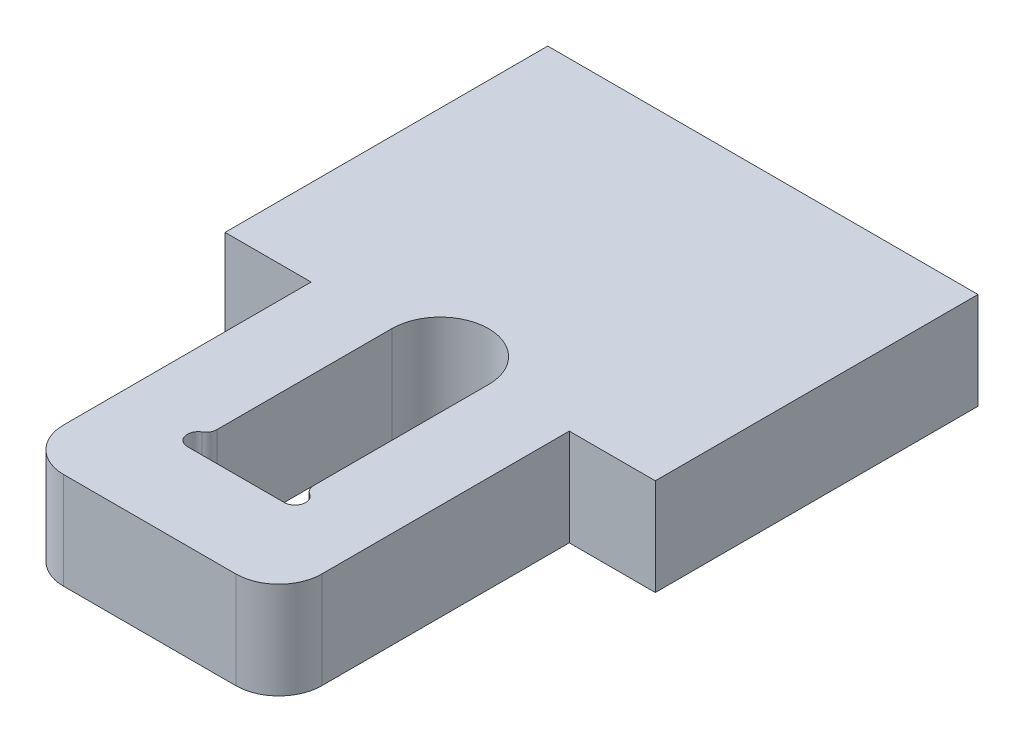
ISO-10303-21;
HEADER;
FILE_DESCRIPTION(('STEP AP214'),'2;1');
FILE_NAME('part.step','',(''),(''),'','','');
FILE_SCHEMA(('AUTOMOTIVE_DESIGN { 1 0 10303 214 1 1 1 1 }'));
ENDSEC;
DATA;
#1=APPLICATION_CONTEXT('core data for automotive mechanical design processes');
#2=APPLICATION_PROTOCOL_DEFINITION('international standard','automotive_design',2000,#1);
#3=PRODUCT_CONTEXT('',#1,'mechanical');
#4=PRODUCT('Part','Part','',(#3));
#5=PRODUCT_RELATED_PRODUCT_CATEGORY('part','',(#4));
#6=PRODUCT_DEFINITION_FORMATION('','',#4);
#7=PRODUCT_DEFINITION_CONTEXT('part definition',#1,'design');
#8=PRODUCT_DEFINITION('design','',#6,#7);
#9=PRODUCT_DEFINITION_SHAPE('','',#8);
#10=(LENGTH_UNIT() NAMED_UNIT(*) SI_UNIT(.MILLI.,.METRE.));
#11=(NAMED_UNIT(*) PLANE_ANGLE_UNIT() SI_UNIT($,.RADIAN.));
#12=(NAMED_UNIT(*) SI_UNIT($,.STERADIAN.) SOLID_ANGLE_UNIT());
#13=UNCERTAINTY_MEASURE_WITH_UNIT(LENGTH_MEASURE(1.E-05),#10,'distance_accuracy_value','');
#14=(GEOMETRIC_REPRESENTATION_CONTEXT(3) GLOBAL_UNCERTAINTY_ASSIGNED_CONTEXT((#13)) GLOBAL_UNIT_ASSIGNED_CONTEXT((#10,
#11,#12)) REPRESENTATION_CONTEXT('',''));
#15=CARTESIAN_POINT('',(0.,0.,0.));
#16=DIRECTION('',(0.,0.,1.));
#17=DIRECTION('',(1.,0.,0.));
#18=AXIS2_PLACEMENT_3D('',#15,#16,#17);
#19=CARTESIAN_POINT('',(4.,4.5,11.5));
#20=DIRECTION('',(0.,1.,0.));
#21=DIRECTION('',(0.,0.,1.));
#22=AXIS2_PLACEMENT_3D('',#19,#20,#21);
#23=PLANE('',#22);
#24=DIRECTION('',(1.,0.,0.));
#25=VECTOR('',#24,1.);
#26=CARTESIAN_POINT('',(-6.,4.5,0.));
#27=LINE('',#26,#25);
#28=CARTESIAN_POINT('',(-10.,4.5,0.));
#29=VERTEX_POINT('',#28);
#30=CARTESIAN_POINT('',(-6.,4.5,0.));
#31=VERTEX_POINT('',#30);
#32=EDGE_CURVE('E223',#29,#31,#27,.T.);
#33=ORIENTED_EDGE('',*,*,#32,.T.);
#34=DIRECTION('',(0.,0.,1.));
#35=VECTOR('',#34,1.);
#36=CARTESIAN_POINT('',(-6.,4.5,0.));
#37=LINE('',#36,#35);
#38=CARTESIAN_POINT('',(-6.,4.5,11.5));
#39=VERTEX_POINT('',#38);
#40=EDGE_CURVE('E226',#31,#39,#37,.T.);
#41=ORIENTED_EDGE('',*,*,#40,.T.);
#42=CARTESIAN_POINT('',(-4.,4.5,11.5));
#43=DIRECTION('',(0.,1.,0.));
#44=DIRECTION('',(0.,0.,-1.));
#45=AXIS2_PLACEMENT_3D('',#42,#43,#44);
#46=CIRCLE('',#45,2.);
#47=CARTESIAN_POINT('',(-4.,4.5,13.5));
#48=VERTEX_POINT('',#47);
#49=EDGE_CURVE('E229',#39,#48,#46,.T.);
#50=ORIENTED_EDGE('',*,*,#49,.T.);
#51=DIRECTION('',(1.,0.,0.));
#52=VECTOR('',#51,1.);
#53=CARTESIAN_POINT('',(-4.,4.5,13.5));
#54=LINE('',#53,#52);
#55=CARTESIAN_POINT('',(4.,4.5,13.5));
#56=VERTEX_POINT('',#55);
#57=EDGE_CURVE('E231',#48,#56,#54,.T.);
#58=ORIENTED_EDGE('',*,*,#57,.T.);
#59=CARTESIAN_POINT('',(4.,4.5,11.5));
#60=DIRECTION('',(0.,1.,0.));
#61=DIRECTION('',(0.,0.,1.));
#62=AXIS2_PLACEMENT_3D('',#59,#60,#61);
#63=CIRCLE('',#62,2.);
#64=CARTESIAN_POINT('',(6.,4.5,11.5));
#65=VERTEX_POINT('',#64);
#66=EDGE_CURVE('E233',#56,#65,#63,.T.);
#67=ORIENTED_EDGE('',*,*,#66,.T.);
#68=DIRECTION('',(0.,0.,-1.));
#69=VECTOR('',#68,1.);
#70=CARTESIAN_POINT('',(6.,4.5,11.5));
#71=LINE('',#70,#69);
#72=CARTESIAN_POINT('',(6.,4.5,0.));
#73=VERTEX_POINT('',#72);
#74=EDGE_CURVE('E235',#65,#73,#71,.T.);
#75=ORIENTED_EDGE('',*,*,#74,.T.);
#76=DIRECTION('',(1.,0.,0.));
#77=VECTOR('',#76,1.);
#78=CARTESIAN_POINT('',(6.,4.5,0.));
#79=LINE('',#78,#77);
#80=CARTESIAN_POINT('',(10.,4.5,0.));
#81=VERTEX_POINT('',#80);
#82=EDGE_CURVE('E237',#73,#81,#79,.T.);
#83=ORIENTED_EDGE('',*,*,#82,.T.);
#84=DIRECTION('',(0.,0.,-1.));
#85=VECTOR('',#84,1.);
#86=CARTESIAN_POINT('',(10.,4.5,0.));
#87=LINE('',#86,#85);
#88=CARTESIAN_POINT('',(10.,4.5,-15.));
#89=VERTEX_POINT('',#88);
#90=EDGE_CURVE('E239',#81,#89,#87,.T.);
#91=ORIENTED_EDGE('',*,*,#90,.T.);
#92=DIRECTION('',(-1.,0.,0.));
#93=VECTOR('',#92,1.);
#94=CARTESIAN_POINT('',(-10.,4.5,-15.));
#95=LINE('',#94,#93);
#96=CARTESIAN_POINT('',(-10.,4.5,-15.));
#97=VERTEX_POINT('',#96);
#98=EDGE_CURVE('E241',#89,#97,#95,.T.);
#99=ORIENTED_EDGE('',*,*,#98,.T.);
#100=DIRECTION('',(0.,0.,1.));
#101=VECTOR('',#100,1.);
#102=CARTESIAN_POINT('',(-10.,4.5,0.));
#103=LINE('',#102,#101);
#104=EDGE_CURVE('E243',#97,#29,#103,.T.);
#105=ORIENTED_EDGE('',*,*,#104,.T.);
#106=EDGE_LOOP('',(#33,#41,#50,#58,#67,#75,#83,#91,#99,#105));
#107=FACE_BOUND('',#106,.T.);
#108=CARTESIAN_POINT('',(2.75,4.5,8.13397459621556));
#109=DIRECTION('',(0.,-1.,0.));
#110=DIRECTION('',(0.,0.,-1.));
#111=AXIS2_PLACEMENT_3D('',#108,#109,#110);
#112=CIRCLE('',#111,0.5);
#113=CARTESIAN_POINT('',(2.5,4.5,8.56698729810778));
#114=VERTEX_POINT('',#113);
#115=CARTESIAN_POINT('',(2.25,4.5,8.13397459621556));
#116=VERTEX_POINT('',#115);
#117=EDGE_CURVE('E166',#114,#116,#112,.T.);
#118=ORIENTED_EDGE('',*,*,#117,.F.);
#119=CARTESIAN_POINT('',(2.25,4.5,9.));
#120=DIRECTION('',(0.,1.,0.));
#121=DIRECTION('',(0.,0.,1.));
#122=AXIS2_PLACEMENT_3D('',#119,#120,#121);
#123=CIRCLE('',#122,0.499999999999999);
#124=CARTESIAN_POINT('',(2.25,4.5,9.5));
#125=VERTEX_POINT('',#124);
#126=EDGE_CURVE('E158',#125,#114,#123,.T.);
#127=ORIENTED_EDGE('',*,*,#126,.F.);
#128=DIRECTION('',(1.,0.,0.));
#129=VECTOR('',#128,1.);
#130=CARTESIAN_POINT('',(-2.25,4.5,9.5));
#131=LINE('',#130,#129);
#132=CARTESIAN_POINT('',(-2.25,4.5,9.5));
#133=VERTEX_POINT('',#132);
#134=EDGE_CURVE('E191',#133,#125,#131,.T.);
#135=ORIENTED_EDGE('',*,*,#134,.F.);
#136=CARTESIAN_POINT('',(-2.25,4.5,9.));
#137=DIRECTION('',(0.,1.,0.));
#138=DIRECTION('',(0.,0.,-1.));
#139=AXIS2_PLACEMENT_3D('',#136,#137,#138);
#140=CIRCLE('',#139,0.499999999999999);
#141=CARTESIAN_POINT('',(-2.5,4.5,8.56698729810778));
#142=VERTEX_POINT('',#141);
#143=EDGE_CURVE('E189',#142,#133,#140,.T.);
#144=ORIENTED_EDGE('',*,*,#143,.F.);
#145=CARTESIAN_POINT('',(-2.75,4.5,8.13397459621556));
#146=DIRECTION('',(0.,-1.,0.));
#147=DIRECTION('',(0.,0.,1.));
#148=AXIS2_PLACEMENT_3D('',#145,#146,#147);
#149=CIRCLE('',#148,0.5);
#150=CARTESIAN_POINT('',(-2.25,4.5,8.13397459621556));
#151=VERTEX_POINT('',#150);
#152=EDGE_CURVE('E187',#151,#142,#149,.T.);
#153=ORIENTED_EDGE('',*,*,#152,.F.);
#154=DIRECTION('',(0.,0.,1.));
#155=VECTOR('',#154,1.);
#156=CARTESIAN_POINT('',(-2.25,4.5,0.));
#157=LINE('',#156,#155);
#158=CARTESIAN_POINT('',(-2.25,4.5,0.));
#159=VERTEX_POINT('',#158);
#160=EDGE_CURVE('E185',#159,#151,#157,.T.);
#161=ORIENTED_EDGE('',*,*,#160,.F.);
#162=CARTESIAN_POINT('',(0.,4.5,0.));
#163=DIRECTION('',(0.,1.,0.));
#164=DIRECTION('',(0.,0.,-1.));
#165=AXIS2_PLACEMENT_3D('',#162,#163,#164);
#166=CIRCLE('',#165,2.25);
#167=CARTESIAN_POINT('',(2.25,4.5,0.));
#168=VERTEX_POINT('',#167);
#169=EDGE_CURVE('E181',#168,#159,#166,.T.);
#170=ORIENTED_EDGE('',*,*,#169,.F.);
#171=DIRECTION('',(0.,0.,-1.));
#172=VECTOR('',#171,1.);
#173=CARTESIAN_POINT('',(2.25,4.5,0.));
#174=LINE('',#173,#172);
#175=EDGE_CURVE('E179',#116,#168,#174,.T.);
#176=ORIENTED_EDGE('',*,*,#175,.F.);
#177=EDGE_LOOP('',(#118,#127,#135,#144,#153,#161,#170,#176));
#178=FACE_BOUND('',#177,.T.);
#179=ADVANCED_FACE('F33',(#107,#178),#23,.T.);
#180=CARTESIAN_POINT('',(4.,0.,11.5));
#181=DIRECTION('',(0.,1.,0.));
#182=DIRECTION('',(0.,0.,1.));
#183=AXIS2_PLACEMENT_3D('',#180,#181,#182);
#184=PLANE('',#183);
#185=DIRECTION('',(1.,0.,0.));
#186=VECTOR('',#185,1.);
#187=CARTESIAN_POINT('',(-6.,0.,0.));
#188=LINE('',#187,#186);
#189=CARTESIAN_POINT('',(-10.,0.,0.));
#190=VERTEX_POINT('',#189);
#191=CARTESIAN_POINT('',(-6.,0.,0.));
#192=VERTEX_POINT('',#191);
#193=EDGE_CURVE('E174',#190,#192,#188,.T.);
#194=ORIENTED_EDGE('',*,*,#193,.F.);
#195=DIRECTION('',(0.,0.,1.));
#196=VECTOR('',#195,1.);
#197=CARTESIAN_POINT('',(-10.,0.,0.));
#198=LINE('',#197,#196);
#199=CARTESIAN_POINT('',(-10.,0.,-15.));
#200=VERTEX_POINT('',#199);
#201=EDGE_CURVE('E227',#200,#190,#198,.T.);
#202=ORIENTED_EDGE('',*,*,#201,.F.);
#203=DIRECTION('',(-1.,0.,0.));
#204=VECTOR('',#203,1.);
#205=CARTESIAN_POINT('',(-10.,0.,-15.));
#206=LINE('',#205,#204);
#207=CARTESIAN_POINT('',(10.,0.,-15.));
#208=VERTEX_POINT('',#207);
#209=EDGE_CURVE('E262',#208,#200,#206,.T.);
#210=ORIENTED_EDGE('',*,*,#209,.F.);
#211=DIRECTION('',(0.,0.,-1.));
#212=VECTOR('',#211,1.);
#213=CARTESIAN_POINT('',(10.,0.,0.));
#214=LINE('',#213,#212);
#215=CARTESIAN_POINT('',(10.,0.,0.));
#216=VERTEX_POINT('',#215);
#217=EDGE_CURVE('E260',#216,#208,#214,.T.);
#218=ORIENTED_EDGE('',*,*,#217,.F.);
#219=DIRECTION('',(1.,0.,0.));
#220=VECTOR('',#219,1.);
#221=CARTESIAN_POINT('',(6.,0.,0.));
#222=LINE('',#221,#220);
#223=CARTESIAN_POINT('',(6.,0.,0.));
#224=VERTEX_POINT('',#223);
#225=EDGE_CURVE('E258',#224,#216,#222,.T.);
#226=ORIENTED_EDGE('',*,*,#225,.F.);
#227=DIRECTION('',(0.,0.,-1.));
#228=VECTOR('',#227,1.);
#229=CARTESIAN_POINT('',(6.,0.,11.5));
#230=LINE('',#229,#228);
#231=CARTESIAN_POINT('',(6.,0.,11.5));
#232=VERTEX_POINT('',#231);
#233=EDGE_CURVE('E256',#232,#224,#230,.T.);
#234=ORIENTED_EDGE('',*,*,#233,.F.);
#235=CARTESIAN_POINT('',(4.,0.,11.5));
#236=DIRECTION('',(0.,1.,0.));
#237=DIRECTION('',(0.,0.,1.));
#238=AXIS2_PLACEMENT_3D('',#235,#236,#237);
#239=CIRCLE('',#238,2.);
#240=CARTESIAN_POINT('',(4.,0.,13.5));
#241=VERTEX_POINT('',#240);
#242=EDGE_CURVE('E254',#241,#232,#239,.T.);
#243=ORIENTED_EDGE('',*,*,#242,.F.);
#244=DIRECTION('',(1.,0.,0.));
#245=VECTOR('',#244,1.);
#246=CARTESIAN_POINT('',(-4.,0.,13.5));
#247=LINE('',#246,#245);
#248=CARTESIAN_POINT('',(-4.,0.,13.5));
#249=VERTEX_POINT('',#248);
#250=EDGE_CURVE('E252',#249,#241,#247,.T.);
#251=ORIENTED_EDGE('',*,*,#250,.F.);
#252=CARTESIAN_POINT('',(-4.,0.,11.5));
#253=DIRECTION('',(0.,1.,0.));
#254=DIRECTION('',(0.,0.,-1.));
#255=AXIS2_PLACEMENT_3D('',#252,#253,#254);
#256=CIRCLE('',#255,2.);
#257=CARTESIAN_POINT('',(-6.,0.,11.5));
#258=VERTEX_POINT('',#257);
#259=EDGE_CURVE('E250',#258,#249,#256,.T.);
#260=ORIENTED_EDGE('',*,*,#259,.F.);
#261=DIRECTION('',(0.,0.,1.));
#262=VECTOR('',#261,1.);
#263=CARTESIAN_POINT('',(-6.,0.,0.));
#264=LINE('',#263,#262);
#265=EDGE_CURVE('E248',#192,#258,#264,.T.);
#266=ORIENTED_EDGE('',*,*,#265,.F.);
#267=EDGE_LOOP('',(#194,#202,#210,#218,#226,#234,#243,#251,#260,#266));
#268=FACE_BOUND('',#267,.T.);
#269=CARTESIAN_POINT('',(2.25,0.,9.));
#270=DIRECTION('',(0.,1.,0.));
#271=DIRECTION('',(0.,0.,1.));
#272=AXIS2_PLACEMENT_3D('',#269,#270,#271);
#273=CIRCLE('',#272,0.499999999999999);
#274=CARTESIAN_POINT('',(2.25,0.,9.5));
#275=VERTEX_POINT('',#274);
#276=CARTESIAN_POINT('',(2.5,0.,8.56698729810778));
#277=VERTEX_POINT('',#276);
#278=EDGE_CURVE('E56',#275,#277,#273,.T.);
#279=ORIENTED_EDGE('',*,*,#278,.T.);
#280=CARTESIAN_POINT('',(2.75,0.,8.13397459621556));
#281=DIRECTION('',(0.,-1.,0.));
#282=DIRECTION('',(0.,0.,-1.));
#283=AXIS2_PLACEMENT_3D('',#280,#281,#282);
#284=CIRCLE('',#283,0.5);
#285=CARTESIAN_POINT('',(2.25,0.,8.13397459621556));
#286=VERTEX_POINT('',#285);
#287=EDGE_CURVE('E173',#277,#286,#284,.T.);
#288=ORIENTED_EDGE('',*,*,#287,.T.);
#289=DIRECTION('',(0.,0.,-1.));
#290=VECTOR('',#289,1.);
#291=CARTESIAN_POINT('',(2.25,0.,0.));
#292=LINE('',#291,#290);
#293=CARTESIAN_POINT('',(2.25,0.,0.));
#294=VERTEX_POINT('',#293);
#295=EDGE_CURVE('E195',#286,#294,#292,.T.);
#296=ORIENTED_EDGE('',*,*,#295,.T.);
#297=CARTESIAN_POINT('',(0.,0.,0.));
#298=DIRECTION('',(0.,1.,0.));
#299=DIRECTION('',(0.,0.,-1.));
#300=AXIS2_PLACEMENT_3D('',#297,#298,#299);
#301=CIRCLE('',#300,2.25);
#302=CARTESIAN_POINT('',(-2.25,0.,0.));
#303=VERTEX_POINT('',#302);
#304=EDGE_CURVE('E198',#294,#303,#301,.T.);
#305=ORIENTED_EDGE('',*,*,#304,.T.);
#306=DIRECTION('',(0.,0.,1.));
#307=VECTOR('',#306,1.);
#308=CARTESIAN_POINT('',(-2.25,0.,0.));
#309=LINE('',#308,#307);
#310=CARTESIAN_POINT('',(-2.25,0.,8.13397459621556));
#311=VERTEX_POINT('',#310);
#312=EDGE_CURVE('E201',#303,#311,#309,.T.);
#313=ORIENTED_EDGE('',*,*,#312,.T.);
#314=CARTESIAN_POINT('',(-2.75,0.,8.13397459621556));
#315=DIRECTION('',(0.,-1.,0.));
#316=DIRECTION('',(0.,0.,1.));
#317=AXIS2_PLACEMENT_3D('',#314,#315,#316);
#318=CIRCLE('',#317,0.5);
#319=CARTESIAN_POINT('',(-2.5,0.,8.56698729810778));
#320=VERTEX_POINT('',#319);
#321=EDGE_CURVE('E204',#311,#320,#318,.T.);
#322=ORIENTED_EDGE('',*,*,#321,.T.);
#323=CARTESIAN_POINT('',(-2.25,0.,9.));
#324=DIRECTION('',(0.,1.,0.));
#325=DIRECTION('',(0.,0.,-1.));
#326=AXIS2_PLACEMENT_3D('',#323,#324,#325);
#327=CIRCLE('',#326,0.499999999999999);
#328=CARTESIAN_POINT('',(-2.25,0.,9.5));
#329=VERTEX_POINT('',#328);
#330=EDGE_CURVE('E207',#320,#329,#327,.T.);
#331=ORIENTED_EDGE('',*,*,#330,.T.);
#332=DIRECTION('',(1.,0.,0.));
#333=VECTOR('',#332,1.);
#334=CARTESIAN_POINT('',(-2.25,0.,9.5));
#335=LINE('',#334,#333);
#336=EDGE_CURVE('E167',#329,#275,#335,.T.);
#337=ORIENTED_EDGE('',*,*,#336,.T.);
#338=EDGE_LOOP('',(#279,#288,#296,#305,#313,#322,#331,#337));
#339=FACE_BOUND('',#338,.T.);
#340=ADVANCED_FACE('F298',(#268,#339),#184,.F.);
#341=CARTESIAN_POINT('',(-6.,4.5,0.));
#342=DIRECTION('',(0.,0.,-1.));
#343=DIRECTION('',(-1.,0.,0.));
#344=AXIS2_PLACEMENT_3D('',#341,#342,#343);
#345=PLANE('',#344);
#346=ORIENTED_EDGE('',*,*,#193,.T.);
#347=DIRECTION('',(0.,-1.,0.));
#348=VECTOR('',#347,1.);
#349=CARTESIAN_POINT('',(-6.,4.5,0.));
#350=LINE('',#349,#348);
#351=EDGE_CURVE('E11',#31,#192,#350,.T.);
#352=ORIENTED_EDGE('',*,*,#351,.F.);
#353=ORIENTED_EDGE('',*,*,#32,.F.);
#354=DIRECTION('',(0.,-1.,0.));
#355=VECTOR('',#354,1.);
#356=CARTESIAN_POINT('',(-10.,4.5,0.));
#357=LINE('',#356,#355);
#358=EDGE_CURVE('E245',#29,#190,#357,.T.);
#359=ORIENTED_EDGE('',*,*,#358,.T.);
#360=EDGE_LOOP('',(#346,#352,#353,#359));
#361=FACE_BOUND('',#360,.T.);
#362=ADVANCED_FACE('F35',(#361),#345,.F.);
#363=CARTESIAN_POINT('',(-6.,4.5,0.));
#364=DIRECTION('',(1.,0.,0.));
#365=DIRECTION('',(0.,0.,-1.));
#366=AXIS2_PLACEMENT_3D('',#363,#364,#365);
#367=PLANE('',#366);
#368=ORIENTED_EDGE('',*,*,#265,.T.);
#369=DIRECTION('',(0.,-1.,0.));
#370=VECTOR('',#369,1.);
#371=CARTESIAN_POINT('',(-6.,4.5,11.5));
#372=LINE('',#371,#370);
#373=EDGE_CURVE('E41',#39,#258,#372,.T.);
#374=ORIENTED_EDGE('',*,*,#373,.F.);
#375=ORIENTED_EDGE('',*,*,#40,.F.);
#376=ORIENTED_EDGE('',*,*,#351,.T.);
#377=EDGE_LOOP('',(#368,#374,#375,#376));
#378=FACE_BOUND('',#377,.T.);
#379=ADVANCED_FACE('F315',(#378),#367,.F.);
#380=CARTESIAN_POINT('',(-4.,4.5,11.5));
#381=DIRECTION('',(0.,-1.,0.));
#382=DIRECTION('',(0.,0.,-1.));
#383=AXIS2_PLACEMENT_3D('',#380,#381,#382);
#384=CYLINDRICAL_SURFACE('',#383,2.);
#385=ORIENTED_EDGE('',*,*,#259,.T.);
#386=DIRECTION('',(0.,-1.,0.));
#387=VECTOR('',#386,1.);
#388=CARTESIAN_POINT('',(-4.,4.5,13.5));
#389=LINE('',#388,#387);
#390=EDGE_CURVE('E285',#48,#249,#389,.T.);
#391=ORIENTED_EDGE('',*,*,#390,.F.);
#392=ORIENTED_EDGE('',*,*,#49,.F.);
#393=ORIENTED_EDGE('',*,*,#373,.T.);
#394=EDGE_LOOP('',(#385,#391,#392,#393));
#395=FACE_BOUND('',#394,.T.);
#396=ADVANCED_FACE('F292',(#395),#384,.T.);
#397=CARTESIAN_POINT('',(-4.,4.5,13.5));
#398=DIRECTION('',(0.,0.,-1.));
#399=DIRECTION('',(-1.,0.,0.));
#400=AXIS2_PLACEMENT_3D('',#397,#398,#399);
#401=PLANE('',#400);
#402=ORIENTED_EDGE('',*,*,#250,.T.);
#403=DIRECTION('',(0.,-1.,0.));
#404=VECTOR('',#403,1.);
#405=CARTESIAN_POINT('',(4.,4.5,13.5));
#406=LINE('',#405,#404);
#407=EDGE_CURVE('E282',#56,#241,#406,.T.);
#408=ORIENTED_EDGE('',*,*,#407,.F.);
#409=ORIENTED_EDGE('',*,*,#57,.F.);
#410=ORIENTED_EDGE('',*,*,#390,.T.);
#411=EDGE_LOOP('',(#402,#408,#409,#410));
#412=FACE_BOUND('',#411,.T.);
#413=ADVANCED_FACE('F304',(#412),#401,.F.);
#414=CARTESIAN_POINT('',(4.,4.5,11.5));
#415=DIRECTION('',(0.,-1.,0.));
#416=DIRECTION('',(0.,0.,-1.));
#417=AXIS2_PLACEMENT_3D('',#414,#415,#416);
#418=CYLINDRICAL_SURFACE('',#417,2.);
#419=ORIENTED_EDGE('',*,*,#242,.T.);
#420=DIRECTION('',(0.,-1.,0.));
#421=VECTOR('',#420,1.);
#422=CARTESIAN_POINT('',(6.,4.5,11.5));
#423=LINE('',#422,#421);
#424=EDGE_CURVE('E279',#65,#232,#423,.T.);
#425=ORIENTED_EDGE('',*,*,#424,.F.);
#426=ORIENTED_EDGE('',*,*,#66,.F.);
#427=ORIENTED_EDGE('',*,*,#407,.T.);
#428=EDGE_LOOP('',(#419,#425,#426,#427));
#429=FACE_BOUND('',#428,.T.);
#430=ADVANCED_FACE('F308',(#429),#418,.T.);
#431=CARTESIAN_POINT('',(6.,4.5,11.5));
#432=DIRECTION('',(-1.,0.,0.));
#433=DIRECTION('',(0.,0.,1.));
#434=AXIS2_PLACEMENT_3D('',#431,#432,#433);
#435=PLANE('',#434);
#436=ORIENTED_EDGE('',*,*,#233,.T.);
#437=DIRECTION('',(0.,-1.,0.));
#438=VECTOR('',#437,1.);
#439=CARTESIAN_POINT('',(6.,4.5,0.));
#440=LINE('',#439,#438);
#441=EDGE_CURVE('E276',#73,#224,#440,.T.);
#442=ORIENTED_EDGE('',*,*,#441,.F.);
#443=ORIENTED_EDGE('',*,*,#74,.F.);
#444=ORIENTED_EDGE('',*,*,#424,.T.);
#445=EDGE_LOOP('',(#436,#442,#443,#444));
#446=FACE_BOUND('',#445,.T.);
#447=ADVANCED_FACE('F338',(#446),#435,.F.);
#448=CARTESIAN_POINT('',(6.,4.5,0.));
#449=DIRECTION('',(0.,0.,-1.));
#450=DIRECTION('',(-1.,0.,0.));
#451=AXIS2_PLACEMENT_3D('',#448,#449,#450);
#452=PLANE('',#451);
#453=ORIENTED_EDGE('',*,*,#225,.T.);
#454=DIRECTION('',(0.,-1.,0.));
#455=VECTOR('',#454,1.);
#456=CARTESIAN_POINT('',(10.,4.5,0.));
#457=LINE('',#456,#455);
#458=EDGE_CURVE('E273',#81,#216,#457,.T.);
#459=ORIENTED_EDGE('',*,*,#458,.F.);
#460=ORIENTED_EDGE('',*,*,#82,.F.);
#461=ORIENTED_EDGE('',*,*,#441,.T.);
#462=EDGE_LOOP('',(#453,#459,#460,#461));
#463=FACE_BOUND('',#462,.T.);
#464=ADVANCED_FACE('F335',(#463),#452,.F.);
#465=CARTESIAN_POINT('',(10.,4.5,0.));
#466=DIRECTION('',(-1.,0.,0.));
#467=DIRECTION('',(0.,0.,1.));
#468=AXIS2_PLACEMENT_3D('',#465,#466,#467);
#469=PLANE('',#468);
#470=ORIENTED_EDGE('',*,*,#217,.T.);
#471=DIRECTION('',(0.,-1.,0.));
#472=VECTOR('',#471,1.);
#473=CARTESIAN_POINT('',(10.,4.5,-15.));
#474=LINE('',#473,#472);
#475=EDGE_CURVE('E270',#89,#208,#474,.T.);
#476=ORIENTED_EDGE('',*,*,#475,.F.);
#477=ORIENTED_EDGE('',*,*,#90,.F.);
#478=ORIENTED_EDGE('',*,*,#458,.T.);
#479=EDGE_LOOP('',(#470,#476,#477,#478));
#480=FACE_BOUND('',#479,.T.);
#481=ADVANCED_FACE('F331',(#480),#469,.F.);
#482=CARTESIAN_POINT('',(-10.,4.5,-15.));
#483=DIRECTION('',(0.,0.,1.));
#484=DIRECTION('',(1.,0.,0.));
#485=AXIS2_PLACEMENT_3D('',#482,#483,#484);
#486=PLANE('',#485);
#487=ORIENTED_EDGE('',*,*,#209,.T.);
#488=DIRECTION('',(0.,-1.,0.));
#489=VECTOR('',#488,1.);
#490=CARTESIAN_POINT('',(-10.,4.5,-15.));
#491=LINE('',#490,#489);
#492=EDGE_CURVE('E267',#97,#200,#491,.T.);
#493=ORIENTED_EDGE('',*,*,#492,.F.);
#494=ORIENTED_EDGE('',*,*,#98,.F.);
#495=ORIENTED_EDGE('',*,*,#475,.T.);
#496=EDGE_LOOP('',(#487,#493,#494,#495));
#497=FACE_BOUND('',#496,.T.);
#498=ADVANCED_FACE('F327',(#497),#486,.F.);
#499=CARTESIAN_POINT('',(-10.,4.5,0.));
#500=DIRECTION('',(1.,0.,0.));
#501=DIRECTION('',(0.,0.,-1.));
#502=AXIS2_PLACEMENT_3D('',#499,#500,#501);
#503=PLANE('',#502);
#504=ORIENTED_EDGE('',*,*,#201,.T.);
#505=ORIENTED_EDGE('',*,*,#358,.F.);
#506=ORIENTED_EDGE('',*,*,#104,.F.);
#507=ORIENTED_EDGE('',*,*,#492,.T.);
#508=EDGE_LOOP('',(#504,#505,#506,#507));
#509=FACE_BOUND('',#508,.T.);
#510=ADVANCED_FACE('F322',(#509),#503,.F.);
#511=CARTESIAN_POINT('',(2.25,4.5,9.));
#512=DIRECTION('',(0.,-1.,0.));
#513=DIRECTION('',(0.,0.,-1.));
#514=AXIS2_PLACEMENT_3D('',#511,#512,#513);
#515=CYLINDRICAL_SURFACE('',#514,0.499999999999999);
#516=ORIENTED_EDGE('',*,*,#278,.F.);
#517=DIRECTION('',(0.,-1.,0.));
#518=VECTOR('',#517,1.);
#519=CARTESIAN_POINT('',(2.25,4.5,9.5));
#520=LINE('',#519,#518);
#521=EDGE_CURVE('E162',#125,#275,#520,.T.);
#522=ORIENTED_EDGE('',*,*,#521,.F.);
#523=ORIENTED_EDGE('',*,*,#126,.T.);
#524=DIRECTION('',(0.,-1.,0.));
#525=VECTOR('',#524,1.);
#526=CARTESIAN_POINT('',(2.5,4.5,8.56698729810778));
#527=LINE('',#526,#525);
#528=EDGE_CURVE('E161',#114,#277,#527,.T.);
#529=ORIENTED_EDGE('',*,*,#528,.T.);
#530=EDGE_LOOP('',(#516,#522,#523,#529));
#531=FACE_BOUND('',#530,.T.);
#532=ADVANCED_FACE('F160',(#531),#515,.F.);
#533=CARTESIAN_POINT('',(2.75,4.5,8.13397459621556));
#534=DIRECTION('',(0.,-1.,0.));
#535=DIRECTION('',(0.,0.,-1.));
#536=AXIS2_PLACEMENT_3D('',#533,#534,#535);
#537=CYLINDRICAL_SURFACE('',#536,0.5);
#538=ORIENTED_EDGE('',*,*,#287,.F.);
#539=ORIENTED_EDGE('',*,*,#528,.F.);
#540=ORIENTED_EDGE('',*,*,#117,.T.);
#541=DIRECTION('',(0.,-1.,0.));
#542=VECTOR('',#541,1.);
#543=CARTESIAN_POINT('',(2.25,4.5,8.13397459621556));
#544=LINE('',#543,#542);
#545=EDGE_CURVE('E175',#116,#286,#544,.T.);
#546=ORIENTED_EDGE('',*,*,#545,.T.);
#547=EDGE_LOOP('',(#538,#539,#540,#546));
#548=FACE_BOUND('',#547,.T.);
#549=ADVANCED_FACE('F170',(#548),#537,.T.);
#550=CARTESIAN_POINT('',(2.25,4.5,0.));
#551=DIRECTION('',(-1.,0.,0.));
#552=DIRECTION('',(0.,0.,1.));
#553=AXIS2_PLACEMENT_3D('',#550,#551,#552);
#554=PLANE('',#553);
#555=ORIENTED_EDGE('',*,*,#295,.F.);
#556=ORIENTED_EDGE('',*,*,#545,.F.);
#557=ORIENTED_EDGE('',*,*,#175,.T.);
#558=DIRECTION('',(0.,-1.,0.));
#559=VECTOR('',#558,1.);
#560=CARTESIAN_POINT('',(2.25,4.5,0.));
#561=LINE('',#560,#559);
#562=EDGE_CURVE('E220',#168,#294,#561,.T.);
#563=ORIENTED_EDGE('',*,*,#562,.T.);
#564=EDGE_LOOP('',(#555,#556,#557,#563));
#565=FACE_BOUND('',#564,.T.);
#566=ADVANCED_FACE('F384',(#565),#554,.T.);
#567=CARTESIAN_POINT('',(0.,4.5,0.));
#568=DIRECTION('',(0.,-1.,0.));
#569=DIRECTION('',(0.,0.,-1.));
#570=AXIS2_PLACEMENT_3D('',#567,#568,#569);
#571=CYLINDRICAL_SURFACE('',#570,2.25);
#572=ORIENTED_EDGE('',*,*,#304,.F.);
#573=ORIENTED_EDGE('',*,*,#562,.F.);
#574=ORIENTED_EDGE('',*,*,#169,.T.);
#575=DIRECTION('',(0.,-1.,0.));
#576=VECTOR('',#575,1.);
#577=CARTESIAN_POINT('',(-2.25,4.5,0.));
#578=LINE('',#577,#576);
#579=EDGE_CURVE('E218',#159,#303,#578,.T.);
#580=ORIENTED_EDGE('',*,*,#579,.T.);
#581=EDGE_LOOP('',(#572,#573,#574,#580));
#582=FACE_BOUND('',#581,.T.);
#583=ADVANCED_FACE('F390',(#582),#571,.F.);
#584=CARTESIAN_POINT('',(-2.25,4.5,0.));
#585=DIRECTION('',(1.,0.,0.));
#586=DIRECTION('',(0.,0.,-1.));
#587=AXIS2_PLACEMENT_3D('',#584,#585,#586);
#588=PLANE('',#587);
#589=ORIENTED_EDGE('',*,*,#312,.F.);
#590=ORIENTED_EDGE('',*,*,#579,.F.);
#591=ORIENTED_EDGE('',*,*,#160,.T.);
#592=DIRECTION('',(0.,-1.,0.));
#593=VECTOR('',#592,1.);
#594=CARTESIAN_POINT('',(-2.25,4.5,8.13397459621556));
#595=LINE('',#594,#593);
#596=EDGE_CURVE('E216',#151,#311,#595,.T.);
#597=ORIENTED_EDGE('',*,*,#596,.T.);
#598=EDGE_LOOP('',(#589,#590,#591,#597));
#599=FACE_BOUND('',#598,.T.);
#600=ADVANCED_FACE('F398',(#599),#588,.T.);
#601=CARTESIAN_POINT('',(-2.75,4.5,8.13397459621556));
#602=DIRECTION('',(0.,-1.,0.));
#603=DIRECTION('',(0.,0.,-1.));
#604=AXIS2_PLACEMENT_3D('',#601,#602,#603);
#605=CYLINDRICAL_SURFACE('',#604,0.5);
#606=ORIENTED_EDGE('',*,*,#321,.F.);
#607=ORIENTED_EDGE('',*,*,#596,.F.);
#608=ORIENTED_EDGE('',*,*,#152,.T.);
#609=DIRECTION('',(0.,-1.,0.));
#610=VECTOR('',#609,1.);
#611=CARTESIAN_POINT('',(-2.5,4.5,8.56698729810778));
#612=LINE('',#611,#610);
#613=EDGE_CURVE('E214',#142,#320,#612,.T.);
#614=ORIENTED_EDGE('',*,*,#613,.T.);
#615=EDGE_LOOP('',(#606,#607,#608,#614));
#616=FACE_BOUND('',#615,.T.);
#617=ADVANCED_FACE('F406',(#616),#605,.T.);
#618=CARTESIAN_POINT('',(-2.25,4.5,9.));
#619=DIRECTION('',(0.,-1.,0.));
#620=DIRECTION('',(0.,0.,-1.));
#621=AXIS2_PLACEMENT_3D('',#618,#619,#620);
#622=CYLINDRICAL_SURFACE('',#621,0.499999999999999);
#623=ORIENTED_EDGE('',*,*,#330,.F.);
#624=ORIENTED_EDGE('',*,*,#613,.F.);
#625=ORIENTED_EDGE('',*,*,#143,.T.);
#626=DIRECTION('',(0.,-1.,0.));
#627=VECTOR('',#626,1.);
#628=CARTESIAN_POINT('',(-2.25,4.5,9.5));
#629=LINE('',#628,#627);
#630=EDGE_CURVE('E48',#133,#329,#629,.T.);
#631=ORIENTED_EDGE('',*,*,#630,.T.);
#632=EDGE_LOOP('',(#623,#624,#625,#631));
#633=FACE_BOUND('',#632,.T.);
#634=ADVANCED_FACE('F414',(#633),#622,.F.);
#635=CARTESIAN_POINT('',(-2.25,4.5,9.5));
#636=DIRECTION('',(0.,0.,-1.));
#637=DIRECTION('',(-1.,0.,0.));
#638=AXIS2_PLACEMENT_3D('',#635,#636,#637);
#639=PLANE('',#638);
#640=ORIENTED_EDGE('',*,*,#336,.F.);
#641=ORIENTED_EDGE('',*,*,#630,.F.);
#642=ORIENTED_EDGE('',*,*,#134,.T.);
#643=ORIENTED_EDGE('',*,*,#521,.T.);
#644=EDGE_LOOP('',(#640,#641,#642,#643));
#645=FACE_BOUND('',#644,.T.);
#646=ADVANCED_FACE('F422',(#645),#639,.T.);
#647=CLOSED_SHELL('',(#179,#340,#362,#379,#396,#413,#430,#447,#464,#481,#498,#510,#532,#549,
#566,#583,#600,#617,#634,#646));
#648=MANIFOLD_SOLID_BREP('B2',#647);
#649=ADVANCED_BREP_SHAPE_REPRESENTATION('',(#18,#648),#14);
#650=SHAPE_DEFINITION_REPRESENTATION(#9,#649);
ENDSEC;
END-ISO-10303-21;
